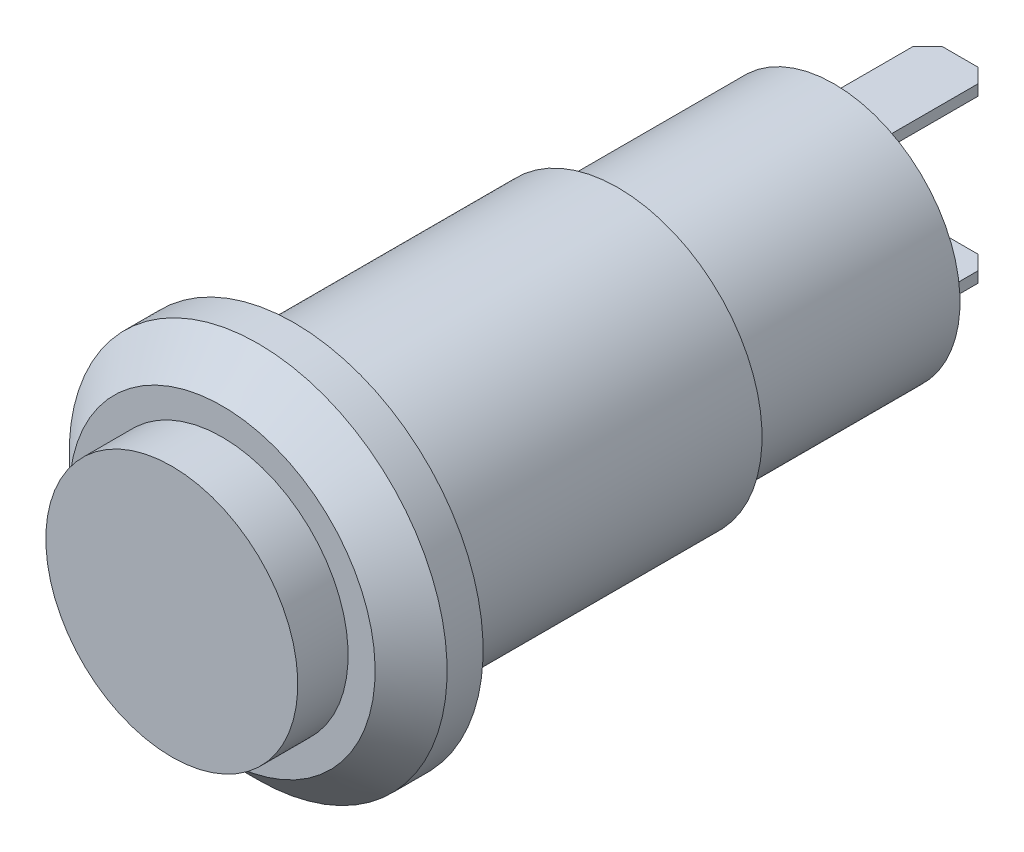
ISO-10303-21;
HEADER;
FILE_DESCRIPTION(('STEP AP214'),'2;1');
FILE_NAME('part.step','',(''),(''),'','','');
FILE_SCHEMA(('AUTOMOTIVE_DESIGN { 1 0 10303 214 1 1 1 1 }'));
ENDSEC;
DATA;
#1=APPLICATION_CONTEXT('core data for automotive mechanical design processes');
#2=APPLICATION_PROTOCOL_DEFINITION('international standard','automotive_design',2000,#1);
#3=PRODUCT_CONTEXT('',#1,'mechanical');
#4=PRODUCT('Part','Part','',(#3));
#5=PRODUCT_RELATED_PRODUCT_CATEGORY('part','',(#4));
#6=PRODUCT_DEFINITION_FORMATION('','',#4);
#7=PRODUCT_DEFINITION_CONTEXT('part definition',#1,'design');
#8=PRODUCT_DEFINITION('design','',#6,#7);
#9=PRODUCT_DEFINITION_SHAPE('','',#8);
#10=(LENGTH_UNIT() NAMED_UNIT(*) SI_UNIT(.MILLI.,.METRE.));
#11=(NAMED_UNIT(*) PLANE_ANGLE_UNIT() SI_UNIT($,.RADIAN.));
#12=(NAMED_UNIT(*) SI_UNIT($,.STERADIAN.) SOLID_ANGLE_UNIT());
#13=UNCERTAINTY_MEASURE_WITH_UNIT(LENGTH_MEASURE(1.E-05),#10,'distance_accuracy_value','');
#14=(GEOMETRIC_REPRESENTATION_CONTEXT(3) GLOBAL_UNCERTAINTY_ASSIGNED_CONTEXT((#13)) GLOBAL_UNIT_ASSIGNED_CONTEXT((#10,
#11,#12)) REPRESENTATION_CONTEXT('',''));
#15=CARTESIAN_POINT('',(0.,0.,0.));
#16=DIRECTION('',(0.,0.,1.));
#17=DIRECTION('',(1.,0.,0.));
#18=AXIS2_PLACEMENT_3D('',#15,#16,#17);
#19=CARTESIAN_POINT('',(0.,3.5,0.));
#20=DIRECTION('',(0.,0.,-1.));
#21=DIRECTION('',(0.,1.,0.));
#22=AXIS2_PLACEMENT_3D('',#19,#20,#21);
#23=PLANE('',#22);
#24=CARTESIAN_POINT('',(0.,0.,0.));
#25=DIRECTION('',(0.,0.,-1.));
#26=DIRECTION('',(0.,1.,0.));
#27=AXIS2_PLACEMENT_3D('',#24,#25,#26);
#28=CIRCLE('',#27,3.5);
#29=CARTESIAN_POINT('',(0.,3.5,0.));
#30=VERTEX_POINT('',#29);
#31=EDGE_CURVE('E209',#30,#30,#28,.T.);
#32=ORIENTED_EDGE('',*,*,#31,.T.);
#33=EDGE_LOOP('',(#32));
#34=FACE_BOUND('',#33,.T.);
#35=DIRECTION('',(1.,0.,0.));
#36=VECTOR('',#35,1.);
#37=CARTESIAN_POINT('',(0.900000000000001,2.4,0.));
#38=LINE('',#37,#36);
#39=CARTESIAN_POINT('',(-0.899999999999999,2.4,0.));
#40=VERTEX_POINT('',#39);
#41=CARTESIAN_POINT('',(0.900000000000001,2.4,0.));
#42=VERTEX_POINT('',#41);
#43=EDGE_CURVE('E187',#40,#42,#38,.T.);
#44=ORIENTED_EDGE('',*,*,#43,.F.);
#45=DIRECTION('',(0.,1.,0.));
#46=VECTOR('',#45,1.);
#47=CARTESIAN_POINT('',(-0.899999999999999,2.1,0.));
#48=LINE('',#47,#46);
#49=CARTESIAN_POINT('',(-0.899999999999999,2.1,0.));
#50=VERTEX_POINT('',#49);
#51=EDGE_CURVE('E142',#50,#40,#48,.T.);
#52=ORIENTED_EDGE('',*,*,#51,.F.);
#53=DIRECTION('',(-1.,0.,0.));
#54=VECTOR('',#53,1.);
#55=CARTESIAN_POINT('',(0.900000000000001,2.1,0.));
#56=LINE('',#55,#54);
#57=CARTESIAN_POINT('',(0.900000000000001,2.1,0.));
#58=VERTEX_POINT('',#57);
#59=EDGE_CURVE('E179',#58,#50,#56,.T.);
#60=ORIENTED_EDGE('',*,*,#59,.F.);
#61=DIRECTION('',(0.,-1.,0.));
#62=VECTOR('',#61,1.);
#63=CARTESIAN_POINT('',(0.900000000000001,2.1,0.));
#64=LINE('',#63,#62);
#65=EDGE_CURVE('E191',#42,#58,#64,.T.);
#66=ORIENTED_EDGE('',*,*,#65,.F.);
#67=EDGE_LOOP('',(#44,#52,#60,#66));
#68=FACE_BOUND('',#67,.T.);
#69=DIRECTION('',(1.,0.,0.));
#70=VECTOR('',#69,1.);
#71=CARTESIAN_POINT('',(0.9,-2.1,0.));
#72=LINE('',#71,#70);
#73=CARTESIAN_POINT('',(-0.9,-2.1,0.));
#74=VERTEX_POINT('',#73);
#75=CARTESIAN_POINT('',(0.9,-2.1,0.));
#76=VERTEX_POINT('',#75);
#77=EDGE_CURVE('E138',#74,#76,#72,.T.);
#78=ORIENTED_EDGE('',*,*,#77,.F.);
#79=DIRECTION('',(0.,1.,0.));
#80=VECTOR('',#79,1.);
#81=CARTESIAN_POINT('',(-0.9,-2.4,0.));
#82=LINE('',#81,#80);
#83=CARTESIAN_POINT('',(-0.9,-2.4,0.));
#84=VERTEX_POINT('',#83);
#85=EDGE_CURVE('E146',#84,#74,#82,.T.);
#86=ORIENTED_EDGE('',*,*,#85,.F.);
#87=DIRECTION('',(-1.,0.,0.));
#88=VECTOR('',#87,1.);
#89=CARTESIAN_POINT('',(0.9,-2.4,0.));
#90=LINE('',#89,#88);
#91=CARTESIAN_POINT('',(0.9,-2.4,0.));
#92=VERTEX_POINT('',#91);
#93=EDGE_CURVE('E159',#92,#84,#90,.T.);
#94=ORIENTED_EDGE('',*,*,#93,.F.);
#95=DIRECTION('',(0.,-1.,0.));
#96=VECTOR('',#95,1.);
#97=CARTESIAN_POINT('',(0.9,-2.4,0.));
#98=LINE('',#97,#96);
#99=EDGE_CURVE('E155',#76,#92,#98,.T.);
#100=ORIENTED_EDGE('',*,*,#99,.F.);
#101=EDGE_LOOP('',(#78,#86,#94,#100));
#102=FACE_BOUND('',#101,.T.);
#103=ADVANCED_FACE('F42',(#34,#68,#102),#23,.T.);
#104=CARTESIAN_POINT('',(0.,0.,18.4));
#105=DIRECTION('',(0.,0.,1.));
#106=DIRECTION('',(0.,-1.,0.));
#107=AXIS2_PLACEMENT_3D('',#104,#105,#106);
#108=PLANE('',#107);
#109=CARTESIAN_POINT('',(0.,0.,18.4));
#110=DIRECTION('',(0.,0.,-1.));
#111=DIRECTION('',(0.,1.,0.));
#112=AXIS2_PLACEMENT_3D('',#109,#110,#111);
#113=CIRCLE('',#112,3.5);
#114=CARTESIAN_POINT('',(0.,3.5,18.4));
#115=VERTEX_POINT('',#114);
#116=EDGE_CURVE('E233',#115,#115,#113,.T.);
#117=ORIENTED_EDGE('',*,*,#116,.F.);
#118=EDGE_LOOP('',(#117));
#119=FACE_BOUND('',#118,.T.);
#120=ADVANCED_FACE('F320',(#119),#108,.T.);
#121=CARTESIAN_POINT('',(0.,0.,0.));
#122=DIRECTION('',(0.,0.,-1.));
#123=DIRECTION('',(0.,1.,0.));
#124=AXIS2_PLACEMENT_3D('',#121,#122,#123);
#125=CYLINDRICAL_SURFACE('',#124,3.5);
#126=ORIENTED_EDGE('',*,*,#116,.T.);
#127=EDGE_LOOP('',(#126));
#128=FACE_BOUND('',#127,.T.);
#129=CARTESIAN_POINT('',(0.,0.,17.));
#130=DIRECTION('',(0.,0.,-1.));
#131=DIRECTION('',(0.,1.,0.));
#132=AXIS2_PLACEMENT_3D('',#129,#130,#131);
#133=CIRCLE('',#132,3.5);
#134=CARTESIAN_POINT('',(0.,3.5,17.));
#135=VERTEX_POINT('',#134);
#136=EDGE_CURVE('E229',#135,#135,#133,.T.);
#137=ORIENTED_EDGE('',*,*,#136,.F.);
#138=EDGE_LOOP('',(#137));
#139=FACE_BOUND('',#138,.T.);
#140=ADVANCED_FACE('F326',(#128,#139),#125,.T.);
#141=CARTESIAN_POINT('',(0.,3.5,17.));
#142=DIRECTION('',(0.,0.,1.));
#143=DIRECTION('',(0.,-1.,0.));
#144=AXIS2_PLACEMENT_3D('',#141,#142,#143);
#145=PLANE('',#144);
#146=CARTESIAN_POINT('',(0.,0.,17.));
#147=DIRECTION('',(0.,0.,1.));
#148=DIRECTION('',(0.,-1.,0.));
#149=AXIS2_PLACEMENT_3D('',#146,#147,#148);
#150=CIRCLE('',#149,4.25);
#151=CARTESIAN_POINT('',(0.,-4.25,17.));
#152=VERTEX_POINT('',#151);
#153=EDGE_CURVE('E241',#152,#152,#150,.T.);
#154=ORIENTED_EDGE('',*,*,#153,.T.);
#155=EDGE_LOOP('',(#154));
#156=FACE_BOUND('',#155,.T.);
#157=ORIENTED_EDGE('',*,*,#136,.T.);
#158=EDGE_LOOP('',(#157));
#159=FACE_BOUND('',#158,.T.);
#160=ADVANCED_FACE('F415',(#156,#159),#145,.T.);
#161=CARTESIAN_POINT('',(0.,0.,0.));
#162=DIRECTION('',(0.,0.,-1.));
#163=DIRECTION('',(0.,1.,0.));
#164=AXIS2_PLACEMENT_3D('',#161,#162,#163);
#165=CYLINDRICAL_SURFACE('',#164,5.25);
#166=CARTESIAN_POINT('',(0.,0.,16.));
#167=DIRECTION('',(0.,0.,1.));
#168=DIRECTION('',(0.,-1.,0.));
#169=AXIS2_PLACEMENT_3D('',#166,#167,#168);
#170=CIRCLE('',#169,5.25);
#171=CARTESIAN_POINT('',(0.,-5.25,16.));
#172=VERTEX_POINT('',#171);
#173=EDGE_CURVE('E237',#172,#172,#170,.F.);
#174=ORIENTED_EDGE('',*,*,#173,.T.);
#175=EDGE_LOOP('',(#174));
#176=FACE_BOUND('',#175,.T.);
#177=CARTESIAN_POINT('',(0.,0.,15.));
#178=DIRECTION('',(0.,0.,-1.));
#179=DIRECTION('',(0.,1.,0.));
#180=AXIS2_PLACEMENT_3D('',#177,#178,#179);
#181=CIRCLE('',#180,5.25);
#182=CARTESIAN_POINT('',(0.,5.25,15.));
#183=VERTEX_POINT('',#182);
#184=EDGE_CURVE('E225',#183,#183,#181,.T.);
#185=ORIENTED_EDGE('',*,*,#184,.F.);
#186=EDGE_LOOP('',(#185));
#187=FACE_BOUND('',#186,.T.);
#188=ADVANCED_FACE('F411',(#176,#187),#165,.T.);
#189=CARTESIAN_POINT('',(0.,5.25,15.));
#190=DIRECTION('',(0.,0.,-1.));
#191=DIRECTION('',(0.,1.,0.));
#192=AXIS2_PLACEMENT_3D('',#189,#190,#191);
#193=PLANE('',#192);
#194=ORIENTED_EDGE('',*,*,#184,.T.);
#195=EDGE_LOOP('',(#194));
#196=FACE_BOUND('',#195,.T.);
#197=CARTESIAN_POINT('',(0.,0.,15.));
#198=DIRECTION('',(0.,0.,-1.));
#199=DIRECTION('',(0.,1.,0.));
#200=AXIS2_PLACEMENT_3D('',#197,#198,#199);
#201=CIRCLE('',#200,4.);
#202=CARTESIAN_POINT('',(0.,4.,15.));
#203=VERTEX_POINT('',#202);
#204=EDGE_CURVE('E221',#203,#203,#201,.T.);
#205=ORIENTED_EDGE('',*,*,#204,.F.);
#206=EDGE_LOOP('',(#205));
#207=FACE_BOUND('',#206,.T.);
#208=ADVANCED_FACE('F407',(#196,#207),#193,.T.);
#209=CARTESIAN_POINT('',(0.,0.,0.));
#210=DIRECTION('',(0.,0.,-1.));
#211=DIRECTION('',(0.,1.,0.));
#212=AXIS2_PLACEMENT_3D('',#209,#210,#211);
#213=CYLINDRICAL_SURFACE('',#212,4.);
#214=ORIENTED_EDGE('',*,*,#204,.T.);
#215=EDGE_LOOP('',(#214));
#216=FACE_BOUND('',#215,.T.);
#217=CARTESIAN_POINT('',(0.,0.,6.));
#218=DIRECTION('',(0.,0.,-1.));
#219=DIRECTION('',(0.,1.,0.));
#220=AXIS2_PLACEMENT_3D('',#217,#218,#219);
#221=CIRCLE('',#220,4.);
#222=CARTESIAN_POINT('',(0.,4.,6.));
#223=VERTEX_POINT('',#222);
#224=EDGE_CURVE('E217',#223,#223,#221,.T.);
#225=ORIENTED_EDGE('',*,*,#224,.F.);
#226=EDGE_LOOP('',(#225));
#227=FACE_BOUND('',#226,.T.);
#228=ADVANCED_FACE('F403',(#216,#227),#213,.T.);
#229=CARTESIAN_POINT('',(0.,4.,6.));
#230=DIRECTION('',(0.,0.,-1.));
#231=DIRECTION('',(0.,1.,0.));
#232=AXIS2_PLACEMENT_3D('',#229,#230,#231);
#233=PLANE('',#232);
#234=ORIENTED_EDGE('',*,*,#224,.T.);
#235=EDGE_LOOP('',(#234));
#236=FACE_BOUND('',#235,.T.);
#237=CARTESIAN_POINT('',(0.,0.,6.));
#238=DIRECTION('',(0.,0.,-1.));
#239=DIRECTION('',(0.,1.,0.));
#240=AXIS2_PLACEMENT_3D('',#237,#238,#239);
#241=CIRCLE('',#240,3.5);
#242=CARTESIAN_POINT('',(0.,3.5,6.));
#243=VERTEX_POINT('',#242);
#244=EDGE_CURVE('E213',#243,#243,#241,.T.);
#245=ORIENTED_EDGE('',*,*,#244,.F.);
#246=EDGE_LOOP('',(#245));
#247=FACE_BOUND('',#246,.T.);
#248=ADVANCED_FACE('F399',(#236,#247),#233,.T.);
#249=CARTESIAN_POINT('',(0.,0.,0.));
#250=DIRECTION('',(0.,0.,-1.));
#251=DIRECTION('',(0.,1.,0.));
#252=AXIS2_PLACEMENT_3D('',#249,#250,#251);
#253=CYLINDRICAL_SURFACE('',#252,3.5);
#254=ORIENTED_EDGE('',*,*,#244,.T.);
#255=EDGE_LOOP('',(#254));
#256=FACE_BOUND('',#255,.T.);
#257=ORIENTED_EDGE('',*,*,#31,.F.);
#258=EDGE_LOOP('',(#257));
#259=FACE_BOUND('',#258,.T.);
#260=ADVANCED_FACE('F396',(#256,#259),#253,.T.);
#261=CARTESIAN_POINT('',(-0.899999999999999,2.1,-3.5));
#262=DIRECTION('',(1.,0.,0.));
#263=DIRECTION('',(0.,1.,0.));
#264=AXIS2_PLACEMENT_3D('',#261,#262,#263);
#265=PLANE('',#264);
#266=DIRECTION('',(0.,0.,1.));
#267=VECTOR('',#266,1.);
#268=CARTESIAN_POINT('',(-0.899999999999999,2.4,-3.5));
#269=LINE('',#268,#267);
#270=CARTESIAN_POINT('',(-0.899999999999999,2.4,-3.1));
#271=VERTEX_POINT('',#270);
#272=EDGE_CURVE('E206',#271,#40,#269,.T.);
#273=ORIENTED_EDGE('',*,*,#272,.F.);
#274=DIRECTION('',(0.,-1.,0.));
#275=VECTOR('',#274,1.);
#276=CARTESIAN_POINT('',(-0.899999999999999,2.1,-3.1));
#277=LINE('',#276,#275);
#278=CARTESIAN_POINT('',(-0.899999999999999,2.1,-3.1));
#279=VERTEX_POINT('',#278);
#280=EDGE_CURVE('E259',#271,#279,#277,.T.);
#281=ORIENTED_EDGE('',*,*,#280,.T.);
#282=DIRECTION('',(0.,0.,1.));
#283=VECTOR('',#282,1.);
#284=CARTESIAN_POINT('',(-0.899999999999999,2.1,-3.5));
#285=LINE('',#284,#283);
#286=EDGE_CURVE('E183',#279,#50,#285,.T.);
#287=ORIENTED_EDGE('',*,*,#286,.T.);
#288=ORIENTED_EDGE('',*,*,#51,.T.);
#289=EDGE_LOOP('',(#273,#281,#287,#288));
#290=FACE_BOUND('',#289,.T.);
#291=ADVANCED_FACE('F315',(#290),#265,.F.);
#292=CARTESIAN_POINT('',(0.900000000000001,2.4,-3.5));
#293=DIRECTION('',(0.,-1.,0.));
#294=DIRECTION('',(0.,0.,-1.));
#295=AXIS2_PLACEMENT_3D('',#292,#293,#294);
#296=PLANE('',#295);
#297=DIRECTION('',(1.,0.,0.));
#298=VECTOR('',#297,1.);
#299=CARTESIAN_POINT('',(0.900000000000001,2.4,-3.5));
#300=LINE('',#299,#298);
#301=CARTESIAN_POINT('',(-0.500000000000002,2.4,-3.5));
#302=VERTEX_POINT('',#301);
#303=CARTESIAN_POINT('',(0.5,2.4,-3.5));
#304=VERTEX_POINT('',#303);
#305=EDGE_CURVE('E174',#302,#304,#300,.T.);
#306=ORIENTED_EDGE('',*,*,#305,.F.);
#307=DIRECTION('',(0.707106781186544,0.,-0.707106781186551));
#308=VECTOR('',#307,1.);
#309=CARTESIAN_POINT('',(-0.500000000000001,2.4,-3.5));
#310=LINE('',#309,#308);
#311=EDGE_CURVE('E256',#302,#271,#310,.F.);
#312=ORIENTED_EDGE('',*,*,#311,.T.);
#313=ORIENTED_EDGE('',*,*,#272,.T.);
#314=ORIENTED_EDGE('',*,*,#43,.T.);
#315=DIRECTION('',(0.,0.,1.));
#316=VECTOR('',#315,1.);
#317=CARTESIAN_POINT('',(0.900000000000001,2.4,-3.5));
#318=LINE('',#317,#316);
#319=CARTESIAN_POINT('',(0.900000000000001,2.4,-3.1));
#320=VERTEX_POINT('',#319);
#321=EDGE_CURVE('E203',#320,#42,#318,.T.);
#322=ORIENTED_EDGE('',*,*,#321,.F.);
#323=DIRECTION('',(0.707106781186547,0.,0.707106781186548));
#324=VECTOR('',#323,1.);
#325=CARTESIAN_POINT('',(0.499999999999999,2.4,-3.5));
#326=LINE('',#325,#324);
#327=EDGE_CURVE('E253',#320,#304,#326,.F.);
#328=ORIENTED_EDGE('',*,*,#327,.T.);
#329=EDGE_LOOP('',(#306,#312,#313,#314,#322,#328));
#330=FACE_BOUND('',#329,.T.);
#331=ADVANCED_FACE('F297',(#330),#296,.F.);
#332=CARTESIAN_POINT('',(0.900000000000001,2.1,-3.5));
#333=DIRECTION('',(-1.,0.,0.));
#334=DIRECTION('',(0.,-1.,0.));
#335=AXIS2_PLACEMENT_3D('',#332,#333,#334);
#336=PLANE('',#335);
#337=DIRECTION('',(0.,0.,1.));
#338=VECTOR('',#337,1.);
#339=CARTESIAN_POINT('',(0.900000000000001,2.1,-3.5));
#340=LINE('',#339,#338);
#341=CARTESIAN_POINT('',(0.900000000000001,2.1,-3.1));
#342=VERTEX_POINT('',#341);
#343=EDGE_CURVE('E200',#342,#58,#340,.T.);
#344=ORIENTED_EDGE('',*,*,#343,.F.);
#345=DIRECTION('',(0.,1.,0.));
#346=VECTOR('',#345,1.);
#347=CARTESIAN_POINT('',(0.900000000000001,2.1,-3.1));
#348=LINE('',#347,#346);
#349=EDGE_CURVE('E52',#342,#320,#348,.T.);
#350=ORIENTED_EDGE('',*,*,#349,.T.);
#351=ORIENTED_EDGE('',*,*,#321,.T.);
#352=ORIENTED_EDGE('',*,*,#65,.T.);
#353=EDGE_LOOP('',(#344,#350,#351,#352));
#354=FACE_BOUND('',#353,.T.);
#355=ADVANCED_FACE('F292',(#354),#336,.F.);
#356=CARTESIAN_POINT('',(0.900000000000001,2.1,-3.5));
#357=DIRECTION('',(0.,1.,0.));
#358=DIRECTION('',(-1.,0.,0.));
#359=AXIS2_PLACEMENT_3D('',#356,#357,#358);
#360=PLANE('',#359);
#361=ORIENTED_EDGE('',*,*,#286,.F.);
#362=DIRECTION('',(-0.707106781186544,0.,0.707106781186551));
#363=VECTOR('',#362,1.);
#364=CARTESIAN_POINT('',(-0.5,2.1,-3.5));
#365=LINE('',#364,#363);
#366=CARTESIAN_POINT('',(-0.500000000000002,2.1,-3.5));
#367=VERTEX_POINT('',#366);
#368=EDGE_CURVE('E265',#279,#367,#365,.F.);
#369=ORIENTED_EDGE('',*,*,#368,.T.);
#370=DIRECTION('',(-1.,0.,0.));
#371=VECTOR('',#370,1.);
#372=CARTESIAN_POINT('',(0.900000000000001,2.1,-3.5));
#373=LINE('',#372,#371);
#374=CARTESIAN_POINT('',(0.5,2.1,-3.5));
#375=VERTEX_POINT('',#374);
#376=EDGE_CURVE('E178',#375,#367,#373,.T.);
#377=ORIENTED_EDGE('',*,*,#376,.F.);
#378=DIRECTION('',(-0.707106781186547,0.,-0.707106781186548));
#379=VECTOR('',#378,1.);
#380=CARTESIAN_POINT('',(0.5,2.1,-3.5));
#381=LINE('',#380,#379);
#382=EDGE_CURVE('E262',#375,#342,#381,.F.);
#383=ORIENTED_EDGE('',*,*,#382,.T.);
#384=ORIENTED_EDGE('',*,*,#343,.T.);
#385=ORIENTED_EDGE('',*,*,#59,.T.);
#386=EDGE_LOOP('',(#361,#369,#377,#383,#384,#385));
#387=FACE_BOUND('',#386,.T.);
#388=ADVANCED_FACE('F308',(#387),#360,.F.);
#389=CARTESIAN_POINT('',(0.,0.,-3.5));
#390=DIRECTION('',(0.,0.,1.));
#391=DIRECTION('',(0.,-1.,0.));
#392=AXIS2_PLACEMENT_3D('',#389,#390,#391);
#393=PLANE('',#392);
#394=ORIENTED_EDGE('',*,*,#376,.T.);
#395=DIRECTION('',(0.,1.,0.));
#396=VECTOR('',#395,1.);
#397=CARTESIAN_POINT('',(-0.5,0.,-3.5));
#398=LINE('',#397,#396);
#399=EDGE_CURVE('E249',#367,#302,#398,.T.);
#400=ORIENTED_EDGE('',*,*,#399,.T.);
#401=ORIENTED_EDGE('',*,*,#305,.T.);
#402=DIRECTION('',(0.,-1.,0.));
#403=VECTOR('',#402,1.);
#404=CARTESIAN_POINT('',(0.499999999999999,0.,-3.5));
#405=LINE('',#404,#403);
#406=EDGE_CURVE('E245',#304,#375,#405,.T.);
#407=ORIENTED_EDGE('',*,*,#406,.T.);
#408=EDGE_LOOP('',(#394,#400,#401,#407));
#409=FACE_BOUND('',#408,.T.);
#410=ADVANCED_FACE('F304',(#409),#393,.F.);
#411=CARTESIAN_POINT('',(-0.9,-2.4,-3.5));
#412=DIRECTION('',(1.,0.,0.));
#413=DIRECTION('',(0.,1.,0.));
#414=AXIS2_PLACEMENT_3D('',#411,#412,#413);
#415=PLANE('',#414);
#416=DIRECTION('',(0.,0.,1.));
#417=VECTOR('',#416,1.);
#418=CARTESIAN_POINT('',(-0.9,-2.1,-3.5));
#419=LINE('',#418,#417);
#420=CARTESIAN_POINT('',(-0.9,-2.1,-3.1));
#421=VERTEX_POINT('',#420);
#422=EDGE_CURVE('E132',#421,#74,#419,.T.);
#423=ORIENTED_EDGE('',*,*,#422,.F.);
#424=DIRECTION('',(0.,-1.,0.));
#425=VECTOR('',#424,1.);
#426=CARTESIAN_POINT('',(-0.9,-2.4,-3.1));
#427=LINE('',#426,#425);
#428=CARTESIAN_POINT('',(-0.9,-2.4,-3.1));
#429=VERTEX_POINT('',#428);
#430=EDGE_CURVE('E67',#421,#429,#427,.T.);
#431=ORIENTED_EDGE('',*,*,#430,.T.);
#432=DIRECTION('',(0.,0.,1.));
#433=VECTOR('',#432,1.);
#434=CARTESIAN_POINT('',(-0.9,-2.4,-3.5));
#435=LINE('',#434,#433);
#436=EDGE_CURVE('E148',#429,#84,#435,.T.);
#437=ORIENTED_EDGE('',*,*,#436,.T.);
#438=ORIENTED_EDGE('',*,*,#85,.T.);
#439=EDGE_LOOP('',(#423,#431,#437,#438));
#440=FACE_BOUND('',#439,.T.);
#441=ADVANCED_FACE('F147',(#440),#415,.F.);
#442=CARTESIAN_POINT('',(0.9,-2.1,-3.5));
#443=DIRECTION('',(0.,-1.,0.));
#444=DIRECTION('',(0.,0.,-1.));
#445=AXIS2_PLACEMENT_3D('',#442,#443,#444);
#446=PLANE('',#445);
#447=DIRECTION('',(1.,0.,0.));
#448=VECTOR('',#447,1.);
#449=CARTESIAN_POINT('',(0.9,-2.1,-3.5));
#450=LINE('',#449,#448);
#451=CARTESIAN_POINT('',(-0.499999999999999,-2.1,-3.5));
#452=VERTEX_POINT('',#451);
#453=CARTESIAN_POINT('',(0.499999999999999,-2.1,-3.5));
#454=VERTEX_POINT('',#453);
#455=EDGE_CURVE('E165',#452,#454,#450,.T.);
#456=ORIENTED_EDGE('',*,*,#455,.F.);
#457=DIRECTION('',(0.707106781186548,0.,-0.707106781186547));
#458=VECTOR('',#457,1.);
#459=CARTESIAN_POINT('',(-0.499999999999999,-2.1,-3.5));
#460=LINE('',#459,#458);
#461=EDGE_CURVE('E140',#452,#421,#460,.F.);
#462=ORIENTED_EDGE('',*,*,#461,.T.);
#463=ORIENTED_EDGE('',*,*,#422,.T.);
#464=ORIENTED_EDGE('',*,*,#77,.T.);
#465=DIRECTION('',(0.,0.,1.));
#466=VECTOR('',#465,1.);
#467=CARTESIAN_POINT('',(0.9,-2.1,-3.5));
#468=LINE('',#467,#466);
#469=CARTESIAN_POINT('',(0.9,-2.1,-3.1));
#470=VERTEX_POINT('',#469);
#471=EDGE_CURVE('E143',#470,#76,#468,.T.);
#472=ORIENTED_EDGE('',*,*,#471,.F.);
#473=DIRECTION('',(0.707106781186548,0.,0.707106781186547));
#474=VECTOR('',#473,1.);
#475=CARTESIAN_POINT('',(0.499999999999999,-2.1,-3.5));
#476=LINE('',#475,#474);
#477=EDGE_CURVE('E276',#470,#454,#476,.F.);
#478=ORIENTED_EDGE('',*,*,#477,.T.);
#479=EDGE_LOOP('',(#456,#462,#463,#464,#472,#478));
#480=FACE_BOUND('',#479,.T.);
#481=ADVANCED_FACE('F135',(#480),#446,.F.);
#482=CARTESIAN_POINT('',(0.9,-2.4,-3.5));
#483=DIRECTION('',(-1.,0.,0.));
#484=DIRECTION('',(0.,-1.,0.));
#485=AXIS2_PLACEMENT_3D('',#482,#483,#484);
#486=PLANE('',#485);
#487=DIRECTION('',(0.,0.,1.));
#488=VECTOR('',#487,1.);
#489=CARTESIAN_POINT('',(0.9,-2.4,-3.5));
#490=LINE('',#489,#488);
#491=CARTESIAN_POINT('',(0.9,-2.4,-3.1));
#492=VERTEX_POINT('',#491);
#493=EDGE_CURVE('E168',#492,#92,#490,.T.);
#494=ORIENTED_EDGE('',*,*,#493,.F.);
#495=DIRECTION('',(0.,1.,0.));
#496=VECTOR('',#495,1.);
#497=CARTESIAN_POINT('',(0.9,-2.4,-3.1));
#498=LINE('',#497,#496);
#499=EDGE_CURVE('E11',#492,#470,#498,.T.);
#500=ORIENTED_EDGE('',*,*,#499,.T.);
#501=ORIENTED_EDGE('',*,*,#471,.T.);
#502=ORIENTED_EDGE('',*,*,#99,.T.);
#503=EDGE_LOOP('',(#494,#500,#501,#502));
#504=FACE_BOUND('',#503,.T.);
#505=ADVANCED_FACE('F373',(#504),#486,.F.);
#506=CARTESIAN_POINT('',(0.9,-2.4,-3.5));
#507=DIRECTION('',(0.,1.,0.));
#508=DIRECTION('',(0.,0.,1.));
#509=AXIS2_PLACEMENT_3D('',#506,#507,#508);
#510=PLANE('',#509);
#511=ORIENTED_EDGE('',*,*,#436,.F.);
#512=DIRECTION('',(-0.707106781186548,0.,0.707106781186547));
#513=VECTOR('',#512,1.);
#514=CARTESIAN_POINT('',(-0.499999999999999,-2.4,-3.5));
#515=LINE('',#514,#513);
#516=CARTESIAN_POINT('',(-0.499999999999999,-2.4,-3.5));
#517=VERTEX_POINT('',#516);
#518=EDGE_CURVE('E285',#429,#517,#515,.F.);
#519=ORIENTED_EDGE('',*,*,#518,.T.);
#520=DIRECTION('',(-1.,0.,0.));
#521=VECTOR('',#520,1.);
#522=CARTESIAN_POINT('',(0.9,-2.4,-3.5));
#523=LINE('',#522,#521);
#524=CARTESIAN_POINT('',(0.499999999999999,-2.4,-3.5));
#525=VERTEX_POINT('',#524);
#526=EDGE_CURVE('E169',#525,#517,#523,.T.);
#527=ORIENTED_EDGE('',*,*,#526,.F.);
#528=DIRECTION('',(-0.707106781186548,0.,-0.707106781186547));
#529=VECTOR('',#528,1.);
#530=CARTESIAN_POINT('',(0.499999999999999,-2.4,-3.5));
#531=LINE('',#530,#529);
#532=EDGE_CURVE('E59',#525,#492,#531,.F.);
#533=ORIENTED_EDGE('',*,*,#532,.T.);
#534=ORIENTED_EDGE('',*,*,#493,.T.);
#535=ORIENTED_EDGE('',*,*,#93,.T.);
#536=EDGE_LOOP('',(#511,#519,#527,#533,#534,#535));
#537=FACE_BOUND('',#536,.T.);
#538=ADVANCED_FACE('F371',(#537),#510,.F.);
#539=CARTESIAN_POINT('',(0.,0.,-3.5));
#540=DIRECTION('',(0.,0.,1.));
#541=DIRECTION('',(0.,-1.,0.));
#542=AXIS2_PLACEMENT_3D('',#539,#540,#541);
#543=PLANE('',#542);
#544=ORIENTED_EDGE('',*,*,#526,.T.);
#545=DIRECTION('',(0.,1.,0.));
#546=VECTOR('',#545,1.);
#547=CARTESIAN_POINT('',(-0.5,0.,-3.5));
#548=LINE('',#547,#546);
#549=EDGE_CURVE('E272',#517,#452,#548,.T.);
#550=ORIENTED_EDGE('',*,*,#549,.T.);
#551=ORIENTED_EDGE('',*,*,#455,.T.);
#552=DIRECTION('',(0.,-1.,0.));
#553=VECTOR('',#552,1.);
#554=CARTESIAN_POINT('',(0.5,0.,-3.5));
#555=LINE('',#554,#553);
#556=EDGE_CURVE('E268',#454,#525,#555,.T.);
#557=ORIENTED_EDGE('',*,*,#556,.T.);
#558=EDGE_LOOP('',(#544,#550,#551,#557));
#559=FACE_BOUND('',#558,.T.);
#560=ADVANCED_FACE('F338',(#559),#543,.F.);
#561=CARTESIAN_POINT('',(0.,0.,16.));
#562=DIRECTION('',(0.,0.,-1.));
#563=DIRECTION('',(0.,1.,0.));
#564=AXIS2_PLACEMENT_3D('',#561,#562,#563);
#565=CONICAL_SURFACE('',#564,5.25,0.785398163397449);
#566=ORIENTED_EDGE('',*,*,#153,.F.);
#567=EDGE_LOOP('',(#566));
#568=FACE_BOUND('',#567,.T.);
#569=ORIENTED_EDGE('',*,*,#173,.F.);
#570=EDGE_LOOP('',(#569));
#571=FACE_BOUND('',#570,.T.);
#572=ADVANCED_FACE('F332',(#568,#571),#565,.T.);
#573=CARTESIAN_POINT('',(-0.5,0.,-3.5));
#574=DIRECTION('',(0.707106781186551,0.,0.707106781186544));
#575=DIRECTION('',(0.,1.,0.));
#576=AXIS2_PLACEMENT_3D('',#573,#574,#575);
#577=PLANE('',#576);
#578=ORIENTED_EDGE('',*,*,#368,.F.);
#579=ORIENTED_EDGE('',*,*,#280,.F.);
#580=ORIENTED_EDGE('',*,*,#311,.F.);
#581=ORIENTED_EDGE('',*,*,#399,.F.);
#582=EDGE_LOOP('',(#578,#579,#580,#581));
#583=FACE_BOUND('',#582,.T.);
#584=ADVANCED_FACE('F312',(#583),#577,.F.);
#585=CARTESIAN_POINT('',(-0.5,0.,-3.5));
#586=DIRECTION('',(0.707106781186547,0.,0.707106781186548));
#587=DIRECTION('',(0.,1.,0.));
#588=AXIS2_PLACEMENT_3D('',#585,#586,#587);
#589=PLANE('',#588);
#590=ORIENTED_EDGE('',*,*,#518,.F.);
#591=ORIENTED_EDGE('',*,*,#430,.F.);
#592=ORIENTED_EDGE('',*,*,#461,.F.);
#593=ORIENTED_EDGE('',*,*,#549,.F.);
#594=EDGE_LOOP('',(#590,#591,#592,#593));
#595=FACE_BOUND('',#594,.T.);
#596=ADVANCED_FACE('F345',(#595),#589,.F.);
#597=CARTESIAN_POINT('',(0.499999999999999,0.,-3.5));
#598=DIRECTION('',(-0.707106781186548,0.,0.707106781186547));
#599=DIRECTION('',(0.,-1.,0.));
#600=AXIS2_PLACEMENT_3D('',#597,#598,#599);
#601=PLANE('',#600);
#602=ORIENTED_EDGE('',*,*,#327,.F.);
#603=ORIENTED_EDGE('',*,*,#349,.F.);
#604=ORIENTED_EDGE('',*,*,#382,.F.);
#605=ORIENTED_EDGE('',*,*,#406,.F.);
#606=EDGE_LOOP('',(#602,#603,#604,#605));
#607=FACE_BOUND('',#606,.T.);
#608=ADVANCED_FACE('F301',(#607),#601,.F.);
#609=CARTESIAN_POINT('',(0.5,0.,-3.5));
#610=DIRECTION('',(-0.707106781186547,0.,0.707106781186548));
#611=DIRECTION('',(0.,-1.,0.));
#612=AXIS2_PLACEMENT_3D('',#609,#610,#611);
#613=PLANE('',#612);
#614=ORIENTED_EDGE('',*,*,#477,.F.);
#615=ORIENTED_EDGE('',*,*,#499,.F.);
#616=ORIENTED_EDGE('',*,*,#532,.F.);
#617=ORIENTED_EDGE('',*,*,#556,.F.);
#618=EDGE_LOOP('',(#614,#615,#616,#617));
#619=FACE_BOUND('',#618,.T.);
#620=ADVANCED_FACE('F45',(#619),#613,.F.);
#621=CLOSED_SHELL('',(#103,#120,#140,#160,#188,#208,#228,#248,#260,#291,#331,#355,#388,#410,
#441,#481,#505,#538,#560,#572,#584,#596,#608,#620));
#622=MANIFOLD_SOLID_BREP('B2',#621);
#623=ADVANCED_BREP_SHAPE_REPRESENTATION('',(#18,#622),#14);
#624=SHAPE_DEFINITION_REPRESENTATION(#9,#623);
ENDSEC;
END-ISO-10303-21;
